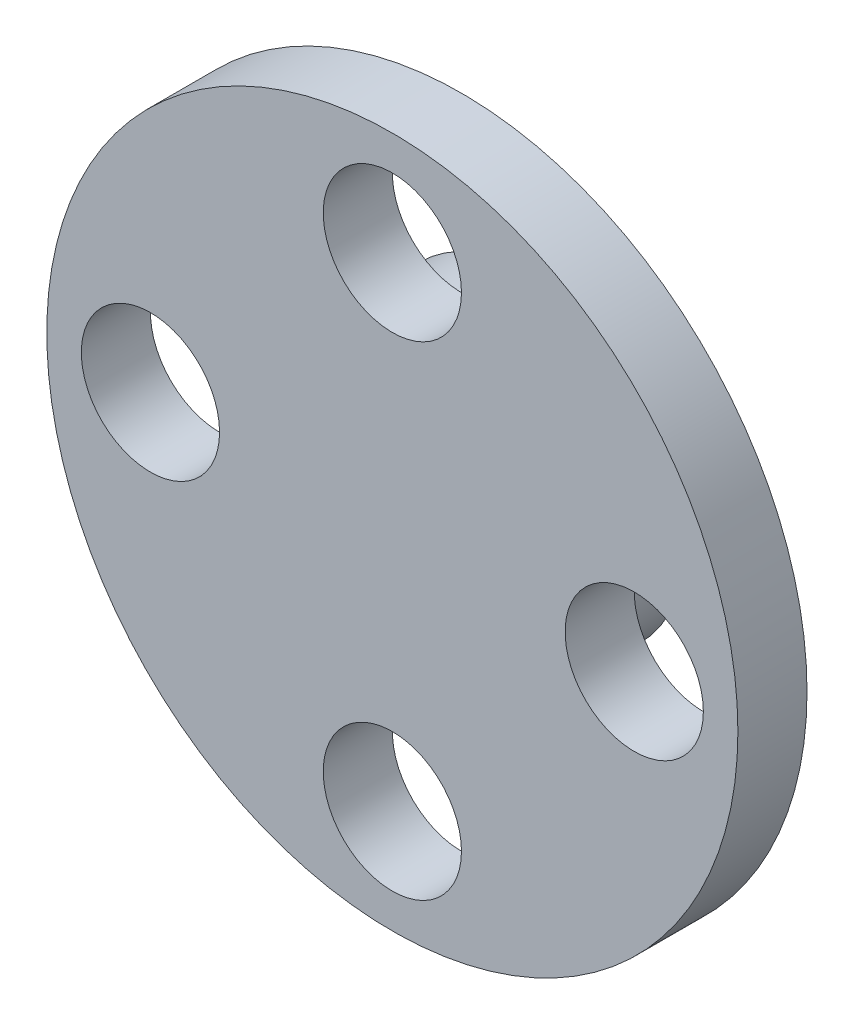
ISO-10303-21;
HEADER;
FILE_DESCRIPTION(('STEP AP214'),'2;1');
FILE_NAME('part.step','',(''),(''),'','','');
FILE_SCHEMA(('AUTOMOTIVE_DESIGN { 1 0 10303 214 1 1 1 1 }'));
ENDSEC;
DATA;
#1=APPLICATION_CONTEXT('core data for automotive mechanical design processes');
#2=APPLICATION_PROTOCOL_DEFINITION('international standard','automotive_design',2000,#1);
#3=PRODUCT_CONTEXT('',#1,'mechanical');
#4=PRODUCT('Part','Part','',(#3));
#5=PRODUCT_RELATED_PRODUCT_CATEGORY('part','',(#4));
#6=PRODUCT_DEFINITION_FORMATION('','',#4);
#7=PRODUCT_DEFINITION_CONTEXT('part definition',#1,'design');
#8=PRODUCT_DEFINITION('design','',#6,#7);
#9=PRODUCT_DEFINITION_SHAPE('','',#8);
#10=(LENGTH_UNIT() NAMED_UNIT(*) SI_UNIT(.MILLI.,.METRE.));
#11=(NAMED_UNIT(*) PLANE_ANGLE_UNIT() SI_UNIT($,.RADIAN.));
#12=(NAMED_UNIT(*) SI_UNIT($,.STERADIAN.) SOLID_ANGLE_UNIT());
#13=UNCERTAINTY_MEASURE_WITH_UNIT(LENGTH_MEASURE(1.E-05),#10,'distance_accuracy_value','');
#14=(GEOMETRIC_REPRESENTATION_CONTEXT(3) GLOBAL_UNCERTAINTY_ASSIGNED_CONTEXT((#13)) GLOBAL_UNIT_ASSIGNED_CONTEXT((#10,
#11,#12)) REPRESENTATION_CONTEXT('',''));
#15=CARTESIAN_POINT('',(0.,0.,0.));
#16=DIRECTION('',(0.,0.,1.));
#17=DIRECTION('',(1.,0.,0.));
#18=AXIS2_PLACEMENT_3D('',#15,#16,#17);
#19=CARTESIAN_POINT('',(0.,0.,2.));
#20=DIRECTION('',(0.,0.,1.));
#21=DIRECTION('',(1.,0.,0.));
#22=AXIS2_PLACEMENT_3D('',#19,#20,#21);
#23=PLANE('',#22);
#24=CARTESIAN_POINT('',(-7.,0.,2.));
#25=DIRECTION('',(0.,0.,1.));
#26=DIRECTION('',(1.,0.,0.));
#27=AXIS2_PLACEMENT_3D('',#24,#25,#26);
#28=CIRCLE('',#27,2.);
#29=CARTESIAN_POINT('',(-5.,0.,2.));
#30=VERTEX_POINT('',#29);
#31=EDGE_CURVE('E67',#30,#30,#28,.T.);
#32=ORIENTED_EDGE('',*,*,#31,.F.);
#33=EDGE_LOOP('',(#32));
#34=FACE_BOUND('',#33,.T.);
#35=CARTESIAN_POINT('',(7.,0.,2.));
#36=DIRECTION('',(0.,0.,1.));
#37=DIRECTION('',(1.,0.,0.));
#38=AXIS2_PLACEMENT_3D('',#35,#36,#37);
#39=CIRCLE('',#38,2.);
#40=CARTESIAN_POINT('',(9.,0.,2.));
#41=VERTEX_POINT('',#40);
#42=EDGE_CURVE('E56',#41,#41,#39,.T.);
#43=ORIENTED_EDGE('',*,*,#42,.F.);
#44=EDGE_LOOP('',(#43));
#45=FACE_BOUND('',#44,.T.);
#46=CARTESIAN_POINT('',(0.,0.,2.));
#47=DIRECTION('',(0.,0.,1.));
#48=DIRECTION('',(1.,0.,0.));
#49=AXIS2_PLACEMENT_3D('',#46,#47,#48);
#50=CIRCLE('',#49,10.);
#51=CARTESIAN_POINT('',(10.,0.,2.));
#52=VERTEX_POINT('',#51);
#53=EDGE_CURVE('E47',#52,#52,#50,.T.);
#54=ORIENTED_EDGE('',*,*,#53,.T.);
#55=EDGE_LOOP('',(#54));
#56=FACE_BOUND('',#55,.T.);
#57=CARTESIAN_POINT('',(0.,7.,2.));
#58=DIRECTION('',(0.,0.,1.));
#59=DIRECTION('',(1.,0.,0.));
#60=AXIS2_PLACEMENT_3D('',#57,#58,#59);
#61=CIRCLE('',#60,2.);
#62=CARTESIAN_POINT('',(2.,7.,2.));
#63=VERTEX_POINT('',#62);
#64=EDGE_CURVE('E61',#63,#63,#61,.T.);
#65=ORIENTED_EDGE('',*,*,#64,.F.);
#66=EDGE_LOOP('',(#65));
#67=FACE_BOUND('',#66,.T.);
#68=CARTESIAN_POINT('',(0.,-7.,2.));
#69=DIRECTION('',(0.,0.,1.));
#70=DIRECTION('',(1.,0.,0.));
#71=AXIS2_PLACEMENT_3D('',#68,#69,#70);
#72=CIRCLE('',#71,2.);
#73=CARTESIAN_POINT('',(2.,-7.,2.));
#74=VERTEX_POINT('',#73);
#75=EDGE_CURVE('E73',#74,#74,#72,.T.);
#76=ORIENTED_EDGE('',*,*,#75,.F.);
#77=EDGE_LOOP('',(#76));
#78=FACE_BOUND('',#77,.T.);
#79=ADVANCED_FACE('F40',(#34,#45,#56,#67,#78),#23,.T.);
#80=CARTESIAN_POINT('',(0.,0.,0.));
#81=DIRECTION('',(0.,0.,1.));
#82=DIRECTION('',(1.,0.,0.));
#83=AXIS2_PLACEMENT_3D('',#80,#81,#82);
#84=PLANE('',#83);
#85=CARTESIAN_POINT('',(0.,0.,0.));
#86=DIRECTION('',(0.,0.,1.));
#87=DIRECTION('',(1.,0.,0.));
#88=AXIS2_PLACEMENT_3D('',#85,#86,#87);
#89=CIRCLE('',#88,4.5);
#90=CARTESIAN_POINT('',(4.5,0.,0.));
#91=VERTEX_POINT('',#90);
#92=EDGE_CURVE('E10',#91,#91,#89,.F.);
#93=ORIENTED_EDGE('',*,*,#92,.F.);
#94=EDGE_LOOP('',(#93));
#95=FACE_BOUND('',#94,.T.);
#96=CARTESIAN_POINT('',(0.,0.,0.));
#97=DIRECTION('',(0.,0.,1.));
#98=DIRECTION('',(1.,0.,0.));
#99=AXIS2_PLACEMENT_3D('',#96,#97,#98);
#100=CIRCLE('',#99,10.);
#101=CARTESIAN_POINT('',(10.,0.,0.));
#102=VERTEX_POINT('',#101);
#103=EDGE_CURVE('E51',#102,#102,#100,.T.);
#104=ORIENTED_EDGE('',*,*,#103,.F.);
#105=EDGE_LOOP('',(#104));
#106=FACE_BOUND('',#105,.T.);
#107=CARTESIAN_POINT('',(7.,0.,0.));
#108=DIRECTION('',(0.,0.,1.));
#109=DIRECTION('',(1.,0.,0.));
#110=AXIS2_PLACEMENT_3D('',#107,#108,#109);
#111=CIRCLE('',#110,2.);
#112=CARTESIAN_POINT('',(9.,0.,0.));
#113=VERTEX_POINT('',#112);
#114=EDGE_CURVE('E58',#113,#113,#111,.T.);
#115=ORIENTED_EDGE('',*,*,#114,.T.);
#116=EDGE_LOOP('',(#115));
#117=FACE_BOUND('',#116,.T.);
#118=CARTESIAN_POINT('',(0.,7.,0.));
#119=DIRECTION('',(0.,0.,1.));
#120=DIRECTION('',(1.,0.,0.));
#121=AXIS2_PLACEMENT_3D('',#118,#119,#120);
#122=CIRCLE('',#121,2.);
#123=CARTESIAN_POINT('',(2.,7.,0.));
#124=VERTEX_POINT('',#123);
#125=EDGE_CURVE('E64',#124,#124,#122,.T.);
#126=ORIENTED_EDGE('',*,*,#125,.T.);
#127=EDGE_LOOP('',(#126));
#128=FACE_BOUND('',#127,.T.);
#129=CARTESIAN_POINT('',(-7.,0.,0.));
#130=DIRECTION('',(0.,0.,1.));
#131=DIRECTION('',(1.,0.,0.));
#132=AXIS2_PLACEMENT_3D('',#129,#130,#131);
#133=CIRCLE('',#132,2.);
#134=CARTESIAN_POINT('',(-5.,0.,0.));
#135=VERTEX_POINT('',#134);
#136=EDGE_CURVE('E70',#135,#135,#133,.T.);
#137=ORIENTED_EDGE('',*,*,#136,.T.);
#138=EDGE_LOOP('',(#137));
#139=FACE_BOUND('',#138,.T.);
#140=CARTESIAN_POINT('',(0.,-7.,0.));
#141=DIRECTION('',(0.,0.,1.));
#142=DIRECTION('',(1.,0.,0.));
#143=AXIS2_PLACEMENT_3D('',#140,#141,#142);
#144=CIRCLE('',#143,2.);
#145=CARTESIAN_POINT('',(2.,-7.,0.));
#146=VERTEX_POINT('',#145);
#147=EDGE_CURVE('E76',#146,#146,#144,.T.);
#148=ORIENTED_EDGE('',*,*,#147,.T.);
#149=EDGE_LOOP('',(#148));
#150=FACE_BOUND('',#149,.T.);
#151=ADVANCED_FACE('F112',(#95,#106,#117,#128,#139,#150),#84,.F.);
#152=CARTESIAN_POINT('',(0.,0.,2.));
#153=DIRECTION('',(0.,0.,-1.));
#154=DIRECTION('',(-1.,0.,0.));
#155=AXIS2_PLACEMENT_3D('',#152,#153,#154);
#156=CYLINDRICAL_SURFACE('',#155,10.);
#157=ORIENTED_EDGE('',*,*,#53,.F.);
#158=EDGE_LOOP('',(#157));
#159=FACE_BOUND('',#158,.T.);
#160=ORIENTED_EDGE('',*,*,#103,.T.);
#161=EDGE_LOOP('',(#160));
#162=FACE_BOUND('',#161,.T.);
#163=ADVANCED_FACE('F42',(#159,#162),#156,.T.);
#164=CARTESIAN_POINT('',(7.,0.,2.));
#165=DIRECTION('',(0.,0.,-1.));
#166=DIRECTION('',(-1.,0.,0.));
#167=AXIS2_PLACEMENT_3D('',#164,#165,#166);
#168=CYLINDRICAL_SURFACE('',#167,2.);
#169=ORIENTED_EDGE('',*,*,#42,.T.);
#170=EDGE_LOOP('',(#169));
#171=FACE_BOUND('',#170,.T.);
#172=ORIENTED_EDGE('',*,*,#114,.F.);
#173=EDGE_LOOP('',(#172));
#174=FACE_BOUND('',#173,.T.);
#175=ADVANCED_FACE('F123',(#171,#174),#168,.F.);
#176=CARTESIAN_POINT('',(0.,7.,2.));
#177=DIRECTION('',(0.,0.,-1.));
#178=DIRECTION('',(-1.,0.,0.));
#179=AXIS2_PLACEMENT_3D('',#176,#177,#178);
#180=CYLINDRICAL_SURFACE('',#179,2.);
#181=ORIENTED_EDGE('',*,*,#64,.T.);
#182=EDGE_LOOP('',(#181));
#183=FACE_BOUND('',#182,.T.);
#184=ORIENTED_EDGE('',*,*,#125,.F.);
#185=EDGE_LOOP('',(#184));
#186=FACE_BOUND('',#185,.T.);
#187=ADVANCED_FACE('F126',(#183,#186),#180,.F.);
#188=CARTESIAN_POINT('',(-7.,0.,2.));
#189=DIRECTION('',(0.,0.,-1.));
#190=DIRECTION('',(-1.,0.,0.));
#191=AXIS2_PLACEMENT_3D('',#188,#189,#190);
#192=CYLINDRICAL_SURFACE('',#191,2.);
#193=ORIENTED_EDGE('',*,*,#31,.T.);
#194=EDGE_LOOP('',(#193));
#195=FACE_BOUND('',#194,.T.);
#196=ORIENTED_EDGE('',*,*,#136,.F.);
#197=EDGE_LOOP('',(#196));
#198=FACE_BOUND('',#197,.T.);
#199=ADVANCED_FACE('F107',(#195,#198),#192,.F.);
#200=CARTESIAN_POINT('',(0.,-7.,2.));
#201=DIRECTION('',(0.,0.,-1.));
#202=DIRECTION('',(-1.,0.,0.));
#203=AXIS2_PLACEMENT_3D('',#200,#201,#202);
#204=CYLINDRICAL_SURFACE('',#203,2.);
#205=ORIENTED_EDGE('',*,*,#75,.T.);
#206=EDGE_LOOP('',(#205));
#207=FACE_BOUND('',#206,.T.);
#208=ORIENTED_EDGE('',*,*,#147,.F.);
#209=EDGE_LOOP('',(#208));
#210=FACE_BOUND('',#209,.T.);
#211=ADVANCED_FACE('F97',(#207,#210),#204,.F.);
#212=CARTESIAN_POINT('',(0.,0.,-2.));
#213=DIRECTION('',(0.,0.,-1.));
#214=DIRECTION('',(-1.,0.,0.));
#215=AXIS2_PLACEMENT_3D('',#212,#213,#214);
#216=PLANE('',#215);
#217=CARTESIAN_POINT('',(0.,0.,-2.));
#218=DIRECTION('',(0.,0.,-1.));
#219=DIRECTION('',(-1.,0.,0.));
#220=AXIS2_PLACEMENT_3D('',#217,#218,#219);
#221=CIRCLE('',#220,4.5);
#222=CARTESIAN_POINT('',(-4.5,0.,-2.));
#223=VERTEX_POINT('',#222);
#224=EDGE_CURVE('E79',#223,#223,#221,.T.);
#225=ORIENTED_EDGE('',*,*,#224,.T.);
#226=EDGE_LOOP('',(#225));
#227=FACE_BOUND('',#226,.T.);
#228=CARTESIAN_POINT('',(0.,0.,-2.));
#229=DIRECTION('',(0.,0.,-1.));
#230=DIRECTION('',(-1.,0.,0.));
#231=AXIS2_PLACEMENT_3D('',#228,#229,#230);
#232=CIRCLE('',#231,3.5);
#233=CARTESIAN_POINT('',(-3.5,0.,-2.));
#234=VERTEX_POINT('',#233);
#235=EDGE_CURVE('E84',#234,#234,#232,.T.);
#236=ORIENTED_EDGE('',*,*,#235,.F.);
#237=EDGE_LOOP('',(#236));
#238=FACE_BOUND('',#237,.T.);
#239=ADVANCED_FACE('F94',(#227,#238),#216,.T.);
#240=CARTESIAN_POINT('',(0.,0.,-2.));
#241=DIRECTION('',(0.,0.,1.));
#242=DIRECTION('',(1.,0.,0.));
#243=AXIS2_PLACEMENT_3D('',#240,#241,#242);
#244=CYLINDRICAL_SURFACE('',#243,4.5);
#245=ORIENTED_EDGE('',*,*,#224,.F.);
#246=EDGE_LOOP('',(#245));
#247=FACE_BOUND('',#246,.T.);
#248=ORIENTED_EDGE('',*,*,#92,.T.);
#249=EDGE_LOOP('',(#248));
#250=FACE_BOUND('',#249,.T.);
#251=ADVANCED_FACE('F96',(#247,#250),#244,.T.);
#252=CARTESIAN_POINT('',(0.,0.,-2.));
#253=DIRECTION('',(0.,0.,1.));
#254=DIRECTION('',(1.,0.,0.));
#255=AXIS2_PLACEMENT_3D('',#252,#253,#254);
#256=CYLINDRICAL_SURFACE('',#255,3.5);
#257=ORIENTED_EDGE('',*,*,#235,.T.);
#258=EDGE_LOOP('',(#257));
#259=FACE_BOUND('',#258,.T.);
#260=CARTESIAN_POINT('',(0.,0.,0.));
#261=DIRECTION('',(0.,0.,-1.));
#262=DIRECTION('',(-1.,0.,0.));
#263=AXIS2_PLACEMENT_3D('',#260,#261,#262);
#264=CIRCLE('',#263,3.5);
#265=CARTESIAN_POINT('',(-3.5,0.,0.));
#266=VERTEX_POINT('',#265);
#267=EDGE_CURVE('E85',#266,#266,#264,.T.);
#268=ORIENTED_EDGE('',*,*,#267,.F.);
#269=EDGE_LOOP('',(#268));
#270=FACE_BOUND('',#269,.T.);
#271=ADVANCED_FACE('F91',(#259,#270),#256,.F.);
#272=ORIENTED_EDGE('',*,*,#267,.T.);
#273=EDGE_LOOP('',(#272));
#274=FACE_BOUND('',#273,.T.);
#275=ADVANCED_FACE('F119',(#274),#84,.F.);
#276=CLOSED_SHELL('',(#79,#151,#163,#175,#187,#199,#211,#239,#251,#271,#275));
#277=MANIFOLD_SOLID_BREP('B2',#276);
#278=ADVANCED_BREP_SHAPE_REPRESENTATION('',(#18,#277),#14);
#279=SHAPE_DEFINITION_REPRESENTATION(#9,#278);
ENDSEC;
END-ISO-10303-21;
